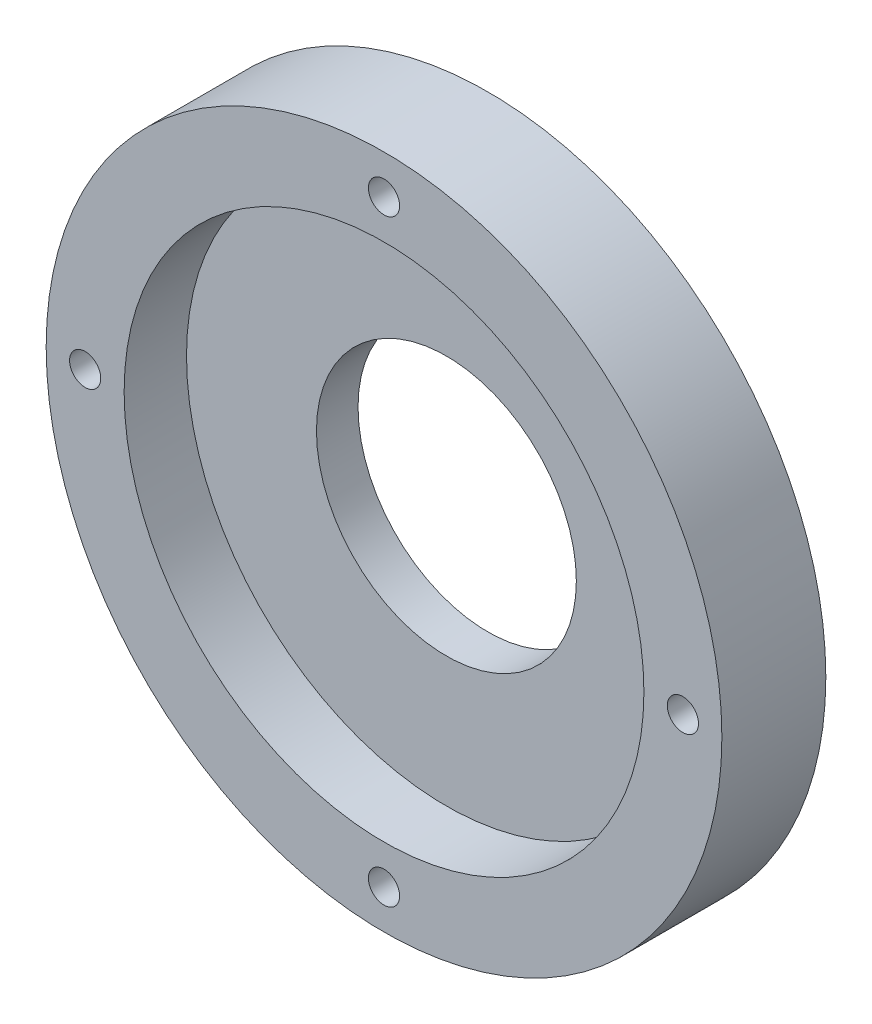
ISO-10303-21;
HEADER;
FILE_DESCRIPTION(('STEP AP214'),'2;1');
FILE_NAME('part.step','',(''),(''),'','','');
FILE_SCHEMA(('AUTOMOTIVE_DESIGN { 1 0 10303 214 1 1 1 1 }'));
ENDSEC;
DATA;
#1=APPLICATION_CONTEXT('core data for automotive mechanical design processes');
#2=APPLICATION_PROTOCOL_DEFINITION('international standard','automotive_design',2000,#1);
#3=PRODUCT_CONTEXT('',#1,'mechanical');
#4=PRODUCT('Part','Part','',(#3));
#5=PRODUCT_RELATED_PRODUCT_CATEGORY('part','',(#4));
#6=PRODUCT_DEFINITION_FORMATION('','',#4);
#7=PRODUCT_DEFINITION_CONTEXT('part definition',#1,'design');
#8=PRODUCT_DEFINITION('design','',#6,#7);
#9=PRODUCT_DEFINITION_SHAPE('','',#8);
#10=(LENGTH_UNIT() NAMED_UNIT(*) SI_UNIT(.MILLI.,.METRE.));
#11=(NAMED_UNIT(*) PLANE_ANGLE_UNIT() SI_UNIT($,.RADIAN.));
#12=(NAMED_UNIT(*) SI_UNIT($,.STERADIAN.) SOLID_ANGLE_UNIT());
#13=UNCERTAINTY_MEASURE_WITH_UNIT(LENGTH_MEASURE(1.E-05),#10,'distance_accuracy_value','');
#14=(GEOMETRIC_REPRESENTATION_CONTEXT(3) GLOBAL_UNCERTAINTY_ASSIGNED_CONTEXT((#13)) GLOBAL_UNIT_ASSIGNED_CONTEXT((#10,
#11,#12)) REPRESENTATION_CONTEXT('',''));
#15=CARTESIAN_POINT('',(0.,0.,0.));
#16=DIRECTION('',(0.,0.,1.));
#17=DIRECTION('',(1.,0.,0.));
#18=AXIS2_PLACEMENT_3D('',#15,#16,#17);
#19=CARTESIAN_POINT('',(0.,0.,4.));
#20=DIRECTION('',(0.,0.,-1.));
#21=DIRECTION('',(-1.,0.,0.));
#22=AXIS2_PLACEMENT_3D('',#19,#20,#21);
#23=CYLINDRICAL_SURFACE('',#22,32.5);
#24=CARTESIAN_POINT('',(0.,0.,0.));
#25=DIRECTION('',(0.,0.,1.));
#26=DIRECTION('',(1.,0.,0.));
#27=AXIS2_PLACEMENT_3D('',#24,#25,#26);
#28=CIRCLE('',#27,32.5);
#29=CARTESIAN_POINT('',(32.5,0.,0.));
#30=VERTEX_POINT('',#29);
#31=EDGE_CURVE('E44',#30,#30,#28,.T.);
#32=ORIENTED_EDGE('',*,*,#31,.T.);
#33=EDGE_LOOP('',(#32));
#34=FACE_BOUND('',#33,.T.);
#35=CARTESIAN_POINT('',(0.,0.,10.));
#36=DIRECTION('',(0.,0.,1.));
#37=DIRECTION('',(1.,0.,0.));
#38=AXIS2_PLACEMENT_3D('',#35,#36,#37);
#39=CIRCLE('',#38,32.5);
#40=CARTESIAN_POINT('',(32.5,0.,10.));
#41=VERTEX_POINT('',#40);
#42=EDGE_CURVE('E49',#41,#41,#39,.T.);
#43=ORIENTED_EDGE('',*,*,#42,.F.);
#44=EDGE_LOOP('',(#43));
#45=FACE_BOUND('',#44,.T.);
#46=ADVANCED_FACE('F36',(#34,#45),#23,.T.);
#47=CARTESIAN_POINT('',(0.,0.,0.));
#48=DIRECTION('',(0.,0.,1.));
#49=DIRECTION('',(1.,0.,0.));
#50=AXIS2_PLACEMENT_3D('',#47,#48,#49);
#51=PLANE('',#50);
#52=CARTESIAN_POINT('',(0.,0.,0.));
#53=DIRECTION('',(0.,0.,-1.));
#54=DIRECTION('',(-1.,0.,0.));
#55=AXIS2_PLACEMENT_3D('',#52,#53,#54);
#56=CIRCLE('',#55,12.5);
#57=CARTESIAN_POINT('',(-12.5,0.,0.));
#58=VERTEX_POINT('',#57);
#59=EDGE_CURVE('E91',#58,#58,#56,.T.);
#60=ORIENTED_EDGE('',*,*,#59,.F.);
#61=EDGE_LOOP('',(#60));
#62=FACE_BOUND('',#61,.T.);
#63=CARTESIAN_POINT('',(0.,28.75,0.));
#64=DIRECTION('',(0.,0.,1.));
#65=DIRECTION('',(1.,0.,0.));
#66=AXIS2_PLACEMENT_3D('',#63,#64,#65);
#67=CIRCLE('',#66,1.5);
#68=CARTESIAN_POINT('',(1.5,28.75,0.));
#69=VERTEX_POINT('',#68);
#70=EDGE_CURVE('E59',#69,#69,#67,.T.);
#71=ORIENTED_EDGE('',*,*,#70,.T.);
#72=EDGE_LOOP('',(#71));
#73=FACE_BOUND('',#72,.T.);
#74=CARTESIAN_POINT('',(28.7500000000008,8.13603286576567E-13,0.));
#75=DIRECTION('',(0.,0.,1.));
#76=DIRECTION('',(1.,0.,0.));
#77=AXIS2_PLACEMENT_3D('',#74,#75,#76);
#78=CIRCLE('',#77,1.50000000000064);
#79=CARTESIAN_POINT('',(30.2500000000015,8.13603286576567E-13,0.));
#80=VERTEX_POINT('',#79);
#81=EDGE_CURVE('E80',#80,#80,#78,.T.);
#82=ORIENTED_EDGE('',*,*,#81,.T.);
#83=EDGE_LOOP('',(#82));
#84=FACE_BOUND('',#83,.T.);
#85=CARTESIAN_POINT('',(1.62720657315313E-12,-28.75,0.));
#86=DIRECTION('',(0.,0.,1.));
#87=DIRECTION('',(1.,0.,0.));
#88=AXIS2_PLACEMENT_3D('',#85,#86,#87);
#89=CIRCLE('',#88,1.50000000000175);
#90=CARTESIAN_POINT('',(1.50000000000338,-28.75,0.));
#91=VERTEX_POINT('',#90);
#92=EDGE_CURVE('E72',#91,#91,#89,.T.);
#93=ORIENTED_EDGE('',*,*,#92,.T.);
#94=EDGE_LOOP('',(#93));
#95=FACE_BOUND('',#94,.T.);
#96=CARTESIAN_POINT('',(-28.7499999999992,-8.17124146124115E-13,0.));
#97=DIRECTION('',(0.,0.,1.));
#98=DIRECTION('',(1.,0.,0.));
#99=AXIS2_PLACEMENT_3D('',#96,#97,#98);
#100=CIRCLE('',#99,1.50000000000131);
#101=CARTESIAN_POINT('',(-27.2499999999979,-8.17124146124115E-13,0.));
#102=VERTEX_POINT('',#101);
#103=EDGE_CURVE('E64',#102,#102,#100,.T.);
#104=ORIENTED_EDGE('',*,*,#103,.T.);
#105=EDGE_LOOP('',(#104));
#106=FACE_BOUND('',#105,.T.);
#107=ORIENTED_EDGE('',*,*,#31,.F.);
#108=EDGE_LOOP('',(#107));
#109=FACE_BOUND('',#108,.T.);
#110=ADVANCED_FACE('F120',(#62,#73,#84,#95,#106,#109),#51,.F.);
#111=CARTESIAN_POINT('',(0.,0.,10.));
#112=DIRECTION('',(0.,0.,1.));
#113=DIRECTION('',(1.,0.,0.));
#114=AXIS2_PLACEMENT_3D('',#111,#112,#113);
#115=PLANE('',#114);
#116=CARTESIAN_POINT('',(0.,28.75,10.));
#117=DIRECTION('',(0.,0.,1.));
#118=DIRECTION('',(1.,0.,0.));
#119=AXIS2_PLACEMENT_3D('',#116,#117,#118);
#120=CIRCLE('',#119,1.5);
#121=CARTESIAN_POINT('',(1.5,28.75,10.));
#122=VERTEX_POINT('',#121);
#123=EDGE_CURVE('E84',#122,#122,#120,.T.);
#124=ORIENTED_EDGE('',*,*,#123,.F.);
#125=EDGE_LOOP('',(#124));
#126=FACE_BOUND('',#125,.T.);
#127=CARTESIAN_POINT('',(28.7500000000008,8.13603286576567E-13,10.));
#128=DIRECTION('',(0.,0.,1.));
#129=DIRECTION('',(1.,0.,0.));
#130=AXIS2_PLACEMENT_3D('',#127,#128,#129);
#131=CIRCLE('',#130,1.50000000000064);
#132=CARTESIAN_POINT('',(30.2500000000015,8.13603286576567E-13,10.));
#133=VERTEX_POINT('',#132);
#134=EDGE_CURVE('E76',#133,#133,#131,.T.);
#135=ORIENTED_EDGE('',*,*,#134,.F.);
#136=EDGE_LOOP('',(#135));
#137=FACE_BOUND('',#136,.T.);
#138=CARTESIAN_POINT('',(1.62720657315313E-12,-28.75,10.));
#139=DIRECTION('',(0.,0.,1.));
#140=DIRECTION('',(1.,0.,0.));
#141=AXIS2_PLACEMENT_3D('',#138,#139,#140);
#142=CIRCLE('',#141,1.50000000000175);
#143=CARTESIAN_POINT('',(1.50000000000338,-28.75,10.));
#144=VERTEX_POINT('',#143);
#145=EDGE_CURVE('E68',#144,#144,#142,.T.);
#146=ORIENTED_EDGE('',*,*,#145,.F.);
#147=EDGE_LOOP('',(#146));
#148=FACE_BOUND('',#147,.T.);
#149=CARTESIAN_POINT('',(-28.7499999999992,-8.17124146124115E-13,10.));
#150=DIRECTION('',(0.,0.,1.));
#151=DIRECTION('',(1.,0.,0.));
#152=AXIS2_PLACEMENT_3D('',#149,#150,#151);
#153=CIRCLE('',#152,1.50000000000131);
#154=CARTESIAN_POINT('',(-27.2499999999979,-8.17124146124115E-13,10.));
#155=VERTEX_POINT('',#154);
#156=EDGE_CURVE('E60',#155,#155,#153,.T.);
#157=ORIENTED_EDGE('',*,*,#156,.F.);
#158=EDGE_LOOP('',(#157));
#159=FACE_BOUND('',#158,.T.);
#160=ORIENTED_EDGE('',*,*,#42,.T.);
#161=EDGE_LOOP('',(#160));
#162=FACE_BOUND('',#161,.T.);
#163=CARTESIAN_POINT('',(0.,0.,10.));
#164=DIRECTION('',(0.,0.,1.));
#165=DIRECTION('',(1.,0.,0.));
#166=AXIS2_PLACEMENT_3D('',#163,#164,#165);
#167=CIRCLE('',#166,25.);
#168=CARTESIAN_POINT('',(25.,0.,10.));
#169=VERTEX_POINT('',#168);
#170=EDGE_CURVE('E55',#169,#169,#167,.T.);
#171=ORIENTED_EDGE('',*,*,#170,.F.);
#172=EDGE_LOOP('',(#171));
#173=FACE_BOUND('',#172,.T.);
#174=ADVANCED_FACE('F115',(#126,#137,#148,#159,#162,#173),#115,.T.);
#175=CARTESIAN_POINT('',(0.,0.,10.));
#176=DIRECTION('',(0.,0.,-1.));
#177=DIRECTION('',(-1.,0.,0.));
#178=AXIS2_PLACEMENT_3D('',#175,#176,#177);
#179=CYLINDRICAL_SURFACE('',#178,25.);
#180=ORIENTED_EDGE('',*,*,#170,.T.);
#181=EDGE_LOOP('',(#180));
#182=FACE_BOUND('',#181,.T.);
#183=CARTESIAN_POINT('',(0.,0.,4.));
#184=DIRECTION('',(0.,0.,1.));
#185=DIRECTION('',(1.,0.,0.));
#186=AXIS2_PLACEMENT_3D('',#183,#184,#185);
#187=CIRCLE('',#186,25.);
#188=CARTESIAN_POINT('',(25.,0.,4.));
#189=VERTEX_POINT('',#188);
#190=EDGE_CURVE('E10',#189,#189,#187,.F.);
#191=ORIENTED_EDGE('',*,*,#190,.T.);
#192=EDGE_LOOP('',(#191));
#193=FACE_BOUND('',#192,.T.);
#194=ADVANCED_FACE('F106',(#182,#193),#179,.F.);
#195=CARTESIAN_POINT('',(0.,0.,4.));
#196=DIRECTION('',(0.,0.,1.));
#197=DIRECTION('',(1.,0.,0.));
#198=AXIS2_PLACEMENT_3D('',#195,#196,#197);
#199=PLANE('',#198);
#200=CARTESIAN_POINT('',(0.,0.,4.));
#201=DIRECTION('',(0.,0.,1.));
#202=DIRECTION('',(1.,0.,0.));
#203=AXIS2_PLACEMENT_3D('',#200,#201,#202);
#204=CIRCLE('',#203,12.5);
#205=CARTESIAN_POINT('',(12.5,0.,4.));
#206=VERTEX_POINT('',#205);
#207=EDGE_CURVE('E39',#206,#206,#204,.T.);
#208=ORIENTED_EDGE('',*,*,#207,.F.);
#209=EDGE_LOOP('',(#208));
#210=FACE_BOUND('',#209,.T.);
#211=ORIENTED_EDGE('',*,*,#190,.F.);
#212=EDGE_LOOP('',(#211));
#213=FACE_BOUND('',#212,.T.);
#214=ADVANCED_FACE('F102',(#210,#213),#199,.T.);
#215=CARTESIAN_POINT('',(-28.7499999999992,-8.17124146124115E-13,0.));
#216=DIRECTION('',(0.,0.,1.));
#217=DIRECTION('',(1.,0.,0.));
#218=AXIS2_PLACEMENT_3D('',#215,#216,#217);
#219=CYLINDRICAL_SURFACE('',#218,1.50000000000131);
#220=ORIENTED_EDGE('',*,*,#103,.F.);
#221=EDGE_LOOP('',(#220));
#222=FACE_BOUND('',#221,.T.);
#223=ORIENTED_EDGE('',*,*,#156,.T.);
#224=EDGE_LOOP('',(#223));
#225=FACE_BOUND('',#224,.T.);
#226=ADVANCED_FACE('F105',(#222,#225),#219,.F.);
#227=CARTESIAN_POINT('',(1.62720657315313E-12,-28.75,0.));
#228=DIRECTION('',(0.,0.,1.));
#229=DIRECTION('',(1.,0.,0.));
#230=AXIS2_PLACEMENT_3D('',#227,#228,#229);
#231=CYLINDRICAL_SURFACE('',#230,1.50000000000175);
#232=ORIENTED_EDGE('',*,*,#92,.F.);
#233=EDGE_LOOP('',(#232));
#234=FACE_BOUND('',#233,.T.);
#235=ORIENTED_EDGE('',*,*,#145,.T.);
#236=EDGE_LOOP('',(#235));
#237=FACE_BOUND('',#236,.T.);
#238=ADVANCED_FACE('F112',(#234,#237),#231,.F.);
#239=CARTESIAN_POINT('',(28.7500000000008,8.13603286576567E-13,0.));
#240=DIRECTION('',(0.,0.,1.));
#241=DIRECTION('',(1.,0.,0.));
#242=AXIS2_PLACEMENT_3D('',#239,#240,#241);
#243=CYLINDRICAL_SURFACE('',#242,1.50000000000064);
#244=ORIENTED_EDGE('',*,*,#81,.F.);
#245=EDGE_LOOP('',(#244));
#246=FACE_BOUND('',#245,.T.);
#247=ORIENTED_EDGE('',*,*,#134,.T.);
#248=EDGE_LOOP('',(#247));
#249=FACE_BOUND('',#248,.T.);
#250=ADVANCED_FACE('F141',(#246,#249),#243,.F.);
#251=CARTESIAN_POINT('',(0.,28.75,0.));
#252=DIRECTION('',(0.,0.,1.));
#253=DIRECTION('',(1.,0.,0.));
#254=AXIS2_PLACEMENT_3D('',#251,#252,#253);
#255=CYLINDRICAL_SURFACE('',#254,1.5);
#256=ORIENTED_EDGE('',*,*,#70,.F.);
#257=EDGE_LOOP('',(#256));
#258=FACE_BOUND('',#257,.T.);
#259=ORIENTED_EDGE('',*,*,#123,.T.);
#260=EDGE_LOOP('',(#259));
#261=FACE_BOUND('',#260,.T.);
#262=ADVANCED_FACE('F145',(#258,#261),#255,.F.);
#263=CARTESIAN_POINT('',(0.,0.,6.));
#264=DIRECTION('',(0.,0.,-1.));
#265=DIRECTION('',(-1.,0.,0.));
#266=AXIS2_PLACEMENT_3D('',#263,#264,#265);
#267=CYLINDRICAL_SURFACE('',#266,12.5);
#268=ORIENTED_EDGE('',*,*,#207,.T.);
#269=EDGE_LOOP('',(#268));
#270=FACE_BOUND('',#269,.T.);
#271=ORIENTED_EDGE('',*,*,#59,.T.);
#272=EDGE_LOOP('',(#271));
#273=FACE_BOUND('',#272,.T.);
#274=ADVANCED_FACE('F100',(#270,#273),#267,.F.);
#275=CLOSED_SHELL('',(#46,#110,#174,#194,#214,#226,#238,#250,#262,#274));
#276=MANIFOLD_SOLID_BREP('B2',#275);
#277=ADVANCED_BREP_SHAPE_REPRESENTATION('',(#18,#276),#14);
#278=SHAPE_DEFINITION_REPRESENTATION(#9,#277);
ENDSEC;
END-ISO-10303-21;
